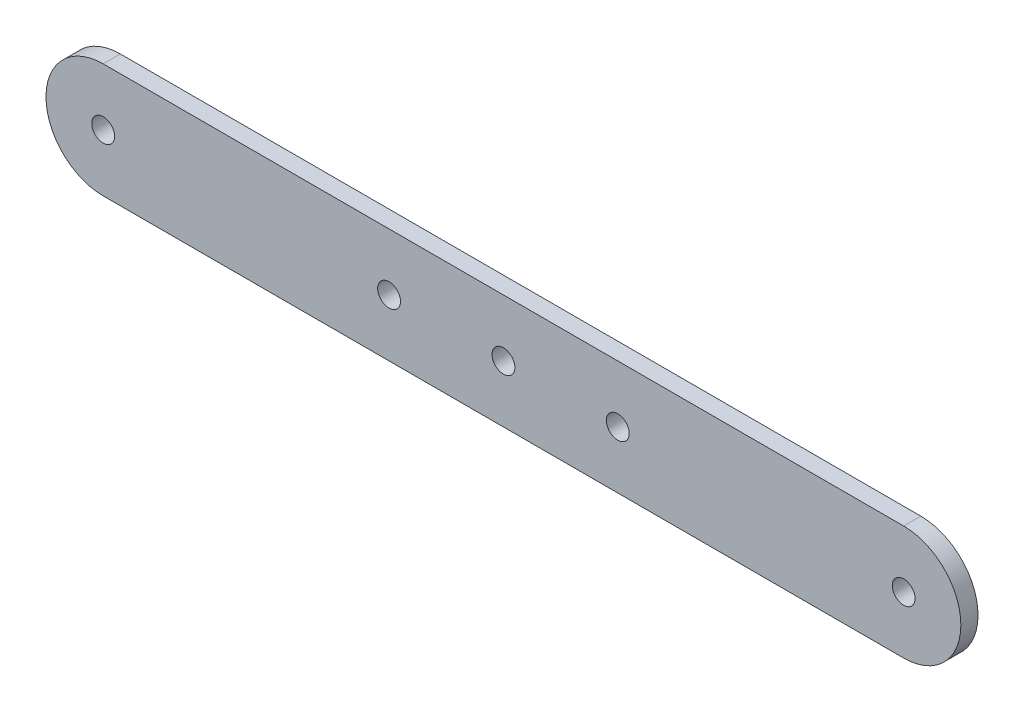
ISO-10303-21;
HEADER;
FILE_DESCRIPTION(('STEP AP214'),'2;1');
FILE_NAME('part.step','',(''),(''),'','','');
FILE_SCHEMA(('AUTOMOTIVE_DESIGN { 1 0 10303 214 1 1 1 1 }'));
ENDSEC;
DATA;
#1=APPLICATION_CONTEXT('core data for automotive mechanical design processes');
#2=APPLICATION_PROTOCOL_DEFINITION('international standard','automotive_design',2000,#1);
#3=PRODUCT_CONTEXT('',#1,'mechanical');
#4=PRODUCT('Part','Part','',(#3));
#5=PRODUCT_RELATED_PRODUCT_CATEGORY('part','',(#4));
#6=PRODUCT_DEFINITION_FORMATION('','',#4);
#7=PRODUCT_DEFINITION_CONTEXT('part definition',#1,'design');
#8=PRODUCT_DEFINITION('design','',#6,#7);
#9=PRODUCT_DEFINITION_SHAPE('','',#8);
#10=(LENGTH_UNIT() NAMED_UNIT(*) SI_UNIT(.MILLI.,.METRE.));
#11=(NAMED_UNIT(*) PLANE_ANGLE_UNIT() SI_UNIT($,.RADIAN.));
#12=(NAMED_UNIT(*) SI_UNIT($,.STERADIAN.) SOLID_ANGLE_UNIT());
#13=UNCERTAINTY_MEASURE_WITH_UNIT(LENGTH_MEASURE(1.E-05),#10,'distance_accuracy_value','');
#14=(GEOMETRIC_REPRESENTATION_CONTEXT(3) GLOBAL_UNCERTAINTY_ASSIGNED_CONTEXT((#13)) GLOBAL_UNIT_ASSIGNED_CONTEXT((#10,
#11,#12)) REPRESENTATION_CONTEXT('',''));
#15=CARTESIAN_POINT('',(0.,0.,0.));
#16=DIRECTION('',(0.,0.,1.));
#17=DIRECTION('',(1.,0.,0.));
#18=AXIS2_PLACEMENT_3D('',#15,#16,#17);
#19=CARTESIAN_POINT('',(-35.,0.,1.5));
#20=DIRECTION('',(0.,0.,-1.));
#21=DIRECTION('',(-1.,0.,0.));
#22=AXIS2_PLACEMENT_3D('',#19,#20,#21);
#23=PLANE('',#22);
#24=CARTESIAN_POINT('',(-35.,0.,1.5));
#25=DIRECTION('',(0.,0.,-1.));
#26=DIRECTION('',(-1.,0.,0.));
#27=AXIS2_PLACEMENT_3D('',#24,#25,#26);
#28=CIRCLE('',#27,5.);
#29=CARTESIAN_POINT('',(-35.,-4.99999999999999,1.5));
#30=VERTEX_POINT('',#29);
#31=CARTESIAN_POINT('',(-35.,5.00000000000001,1.5));
#32=VERTEX_POINT('',#31);
#33=EDGE_CURVE('E169',#30,#32,#28,.T.);
#34=ORIENTED_EDGE('',*,*,#33,.F.);
#35=DIRECTION('',(1.,0.,0.));
#36=VECTOR('',#35,1.);
#37=CARTESIAN_POINT('',(-35.,-4.99999999999999,1.5));
#38=LINE('',#37,#36);
#39=CARTESIAN_POINT('',(35.,-5.00000000000002,1.5));
#40=VERTEX_POINT('',#39);
#41=EDGE_CURVE('E159',#30,#40,#38,.T.);
#42=ORIENTED_EDGE('',*,*,#41,.T.);
#43=CARTESIAN_POINT('',(35.,0.,1.5));
#44=DIRECTION('',(0.,0.,1.));
#45=DIRECTION('',(1.,0.,0.));
#46=AXIS2_PLACEMENT_3D('',#43,#44,#45);
#47=CIRCLE('',#46,5.00000000000002);
#48=CARTESIAN_POINT('',(35.,5.00000000000002,1.5));
#49=VERTEX_POINT('',#48);
#50=EDGE_CURVE('E154',#40,#49,#47,.T.);
#51=ORIENTED_EDGE('',*,*,#50,.T.);
#52=DIRECTION('',(1.,0.,0.));
#53=VECTOR('',#52,1.);
#54=CARTESIAN_POINT('',(-35.,5.00000000000001,1.5));
#55=LINE('',#54,#53);
#56=EDGE_CURVE('E158',#32,#49,#55,.T.);
#57=ORIENTED_EDGE('',*,*,#56,.F.);
#58=EDGE_LOOP('',(#34,#42,#51,#57));
#59=FACE_BOUND('',#58,.T.);
#60=CARTESIAN_POINT('',(-35.,0.,1.5));
#61=DIRECTION('',(0.,0.,1.));
#62=DIRECTION('',(1.,0.,0.));
#63=AXIS2_PLACEMENT_3D('',#60,#61,#62);
#64=CIRCLE('',#63,0.999999999999998);
#65=CARTESIAN_POINT('',(-34.,0.,1.5));
#66=VERTEX_POINT('',#65);
#67=EDGE_CURVE('E179',#66,#66,#64,.T.);
#68=ORIENTED_EDGE('',*,*,#67,.F.);
#69=EDGE_LOOP('',(#68));
#70=FACE_BOUND('',#69,.T.);
#71=CARTESIAN_POINT('',(-10.,0.,1.5));
#72=DIRECTION('',(0.,0.,1.));
#73=DIRECTION('',(1.,0.,0.));
#74=AXIS2_PLACEMENT_3D('',#71,#72,#73);
#75=CIRCLE('',#74,1.);
#76=CARTESIAN_POINT('',(-9.,0.,1.5));
#77=VERTEX_POINT('',#76);
#78=EDGE_CURVE('E221',#77,#77,#75,.T.);
#79=ORIENTED_EDGE('',*,*,#78,.F.);
#80=EDGE_LOOP('',(#79));
#81=FACE_BOUND('',#80,.T.);
#82=CARTESIAN_POINT('',(0.,0.,1.5));
#83=DIRECTION('',(0.,0.,1.));
#84=DIRECTION('',(1.,0.,0.));
#85=AXIS2_PLACEMENT_3D('',#82,#83,#84);
#86=CIRCLE('',#85,1.);
#87=CARTESIAN_POINT('',(1.,0.,1.5));
#88=VERTEX_POINT('',#87);
#89=EDGE_CURVE('E228',#88,#88,#86,.T.);
#90=ORIENTED_EDGE('',*,*,#89,.F.);
#91=EDGE_LOOP('',(#90));
#92=FACE_BOUND('',#91,.T.);
#93=CARTESIAN_POINT('',(10.,0.,1.5));
#94=DIRECTION('',(0.,0.,1.));
#95=DIRECTION('',(1.,0.,0.));
#96=AXIS2_PLACEMENT_3D('',#93,#94,#95);
#97=CIRCLE('',#96,1.);
#98=CARTESIAN_POINT('',(11.,0.,1.5));
#99=VERTEX_POINT('',#98);
#100=EDGE_CURVE('E233',#99,#99,#97,.T.);
#101=ORIENTED_EDGE('',*,*,#100,.F.);
#102=EDGE_LOOP('',(#101));
#103=FACE_BOUND('',#102,.T.);
#104=CARTESIAN_POINT('',(35.,0.,1.5));
#105=DIRECTION('',(0.,0.,1.));
#106=DIRECTION('',(1.,0.,0.));
#107=AXIS2_PLACEMENT_3D('',#104,#105,#106);
#108=CIRCLE('',#107,0.999999999999998);
#109=CARTESIAN_POINT('',(36.,0.,1.5));
#110=VERTEX_POINT('',#109);
#111=EDGE_CURVE('E239',#110,#110,#108,.T.);
#112=ORIENTED_EDGE('',*,*,#111,.F.);
#113=EDGE_LOOP('',(#112));
#114=FACE_BOUND('',#113,.T.);
#115=ADVANCED_FACE('F108',(#59,#70,#81,#92,#103,#114),#23,.F.);
#116=CARTESIAN_POINT('',(-35.,0.,0.));
#117=DIRECTION('',(0.,0.,-1.));
#118=DIRECTION('',(-1.,0.,0.));
#119=AXIS2_PLACEMENT_3D('',#116,#117,#118);
#120=PLANE('',#119);
#121=CARTESIAN_POINT('',(10.,0.,0.));
#122=DIRECTION('',(0.,0.,1.));
#123=DIRECTION('',(1.,0.,0.));
#124=AXIS2_PLACEMENT_3D('',#121,#122,#123);
#125=CIRCLE('',#124,1.);
#126=CARTESIAN_POINT('',(11.,0.,0.));
#127=VERTEX_POINT('',#126);
#128=EDGE_CURVE('E236',#127,#127,#125,.T.);
#129=ORIENTED_EDGE('',*,*,#128,.T.);
#130=EDGE_LOOP('',(#129));
#131=FACE_BOUND('',#130,.T.);
#132=CARTESIAN_POINT('',(-10.,0.,0.));
#133=DIRECTION('',(0.,0.,1.));
#134=DIRECTION('',(1.,0.,0.));
#135=AXIS2_PLACEMENT_3D('',#132,#133,#134);
#136=CIRCLE('',#135,1.);
#137=CARTESIAN_POINT('',(-9.,0.,0.));
#138=VERTEX_POINT('',#137);
#139=EDGE_CURVE('E224',#138,#138,#136,.T.);
#140=ORIENTED_EDGE('',*,*,#139,.T.);
#141=EDGE_LOOP('',(#140));
#142=FACE_BOUND('',#141,.T.);
#143=CARTESIAN_POINT('',(-35.,0.,0.));
#144=DIRECTION('',(0.,0.,-1.));
#145=DIRECTION('',(-1.,0.,0.));
#146=AXIS2_PLACEMENT_3D('',#143,#144,#145);
#147=CIRCLE('',#146,5.);
#148=CARTESIAN_POINT('',(-35.,-4.99999999999999,0.));
#149=VERTEX_POINT('',#148);
#150=CARTESIAN_POINT('',(-35.,5.00000000000001,0.));
#151=VERTEX_POINT('',#150);
#152=EDGE_CURVE('E175',#149,#151,#147,.T.);
#153=ORIENTED_EDGE('',*,*,#152,.T.);
#154=DIRECTION('',(1.,0.,0.));
#155=VECTOR('',#154,1.);
#156=CARTESIAN_POINT('',(-35.,5.00000000000001,0.));
#157=LINE('',#156,#155);
#158=CARTESIAN_POINT('',(35.,5.00000000000002,0.));
#159=VERTEX_POINT('',#158);
#160=EDGE_CURVE('E178',#151,#159,#157,.T.);
#161=ORIENTED_EDGE('',*,*,#160,.T.);
#162=CARTESIAN_POINT('',(35.,0.,0.));
#163=DIRECTION('',(0.,0.,1.));
#164=DIRECTION('',(1.,0.,0.));
#165=AXIS2_PLACEMENT_3D('',#162,#163,#164);
#166=CIRCLE('',#165,5.00000000000002);
#167=CARTESIAN_POINT('',(35.,-5.00000000000002,0.));
#168=VERTEX_POINT('',#167);
#169=EDGE_CURVE('E166',#168,#159,#166,.T.);
#170=ORIENTED_EDGE('',*,*,#169,.F.);
#171=DIRECTION('',(1.,0.,0.));
#172=VECTOR('',#171,1.);
#173=CARTESIAN_POINT('',(-35.,-4.99999999999999,0.));
#174=LINE('',#173,#172);
#175=EDGE_CURVE('E142',#149,#168,#174,.T.);
#176=ORIENTED_EDGE('',*,*,#175,.F.);
#177=EDGE_LOOP('',(#153,#161,#170,#176));
#178=FACE_BOUND('',#177,.T.);
#179=CARTESIAN_POINT('',(-35.,0.,0.));
#180=DIRECTION('',(0.,0.,1.));
#181=DIRECTION('',(1.,0.,0.));
#182=AXIS2_PLACEMENT_3D('',#179,#180,#181);
#183=CIRCLE('',#182,0.999999999999998);
#184=CARTESIAN_POINT('',(-34.,0.,0.));
#185=VERTEX_POINT('',#184);
#186=EDGE_CURVE('E220',#185,#185,#183,.T.);
#187=ORIENTED_EDGE('',*,*,#186,.T.);
#188=EDGE_LOOP('',(#187));
#189=FACE_BOUND('',#188,.T.);
#190=CARTESIAN_POINT('',(0.,0.,0.));
#191=DIRECTION('',(0.,0.,1.));
#192=DIRECTION('',(1.,0.,0.));
#193=AXIS2_PLACEMENT_3D('',#190,#191,#192);
#194=CIRCLE('',#193,1.);
#195=CARTESIAN_POINT('',(1.,0.,0.));
#196=VERTEX_POINT('',#195);
#197=EDGE_CURVE('E230',#196,#196,#194,.T.);
#198=ORIENTED_EDGE('',*,*,#197,.T.);
#199=EDGE_LOOP('',(#198));
#200=FACE_BOUND('',#199,.T.);
#201=CARTESIAN_POINT('',(35.,0.,0.));
#202=DIRECTION('',(0.,0.,1.));
#203=DIRECTION('',(1.,0.,0.));
#204=AXIS2_PLACEMENT_3D('',#201,#202,#203);
#205=CIRCLE('',#204,0.999999999999998);
#206=CARTESIAN_POINT('',(36.,0.,0.));
#207=VERTEX_POINT('',#206);
#208=EDGE_CURVE('E242',#207,#207,#205,.T.);
#209=ORIENTED_EDGE('',*,*,#208,.T.);
#210=EDGE_LOOP('',(#209));
#211=FACE_BOUND('',#210,.T.);
#212=ADVANCED_FACE('F184',(#131,#142,#178,#189,#200,#211),#120,.T.);
#213=CARTESIAN_POINT('',(-35.,0.,1.5));
#214=DIRECTION('',(0.,0.,-1.));
#215=DIRECTION('',(-1.,0.,0.));
#216=AXIS2_PLACEMENT_3D('',#213,#214,#215);
#217=CYLINDRICAL_SURFACE('',#216,5.);
#218=ORIENTED_EDGE('',*,*,#152,.F.);
#219=DIRECTION('',(0.,0.,-1.));
#220=VECTOR('',#219,1.);
#221=CARTESIAN_POINT('',(-35.,-4.99999999999999,1.5));
#222=LINE('',#221,#220);
#223=EDGE_CURVE('E12',#30,#149,#222,.T.);
#224=ORIENTED_EDGE('',*,*,#223,.F.);
#225=ORIENTED_EDGE('',*,*,#33,.T.);
#226=DIRECTION('',(0.,0.,-1.));
#227=VECTOR('',#226,1.);
#228=CARTESIAN_POINT('',(-35.,5.00000000000001,1.5));
#229=LINE('',#228,#227);
#230=EDGE_CURVE('E112',#32,#151,#229,.T.);
#231=ORIENTED_EDGE('',*,*,#230,.T.);
#232=EDGE_LOOP('',(#218,#224,#225,#231));
#233=FACE_BOUND('',#232,.T.);
#234=ADVANCED_FACE('F110',(#233),#217,.T.);
#235=CARTESIAN_POINT('',(-35.,-4.99999999999999,1.5));
#236=DIRECTION('',(0.,1.,0.));
#237=DIRECTION('',(-1.,0.,0.));
#238=AXIS2_PLACEMENT_3D('',#235,#236,#237);
#239=PLANE('',#238);
#240=ORIENTED_EDGE('',*,*,#175,.T.);
#241=DIRECTION('',(0.,0.,-1.));
#242=VECTOR('',#241,1.);
#243=CARTESIAN_POINT('',(35.,-5.00000000000002,1.5));
#244=LINE('',#243,#242);
#245=EDGE_CURVE('E118',#40,#168,#244,.T.);
#246=ORIENTED_EDGE('',*,*,#245,.F.);
#247=ORIENTED_EDGE('',*,*,#41,.F.);
#248=ORIENTED_EDGE('',*,*,#223,.T.);
#249=EDGE_LOOP('',(#240,#246,#247,#248));
#250=FACE_BOUND('',#249,.T.);
#251=ADVANCED_FACE('F187',(#250),#239,.F.);
#252=CARTESIAN_POINT('',(35.,0.,1.5));
#253=DIRECTION('',(0.,0.,-1.));
#254=DIRECTION('',(-1.,0.,0.));
#255=AXIS2_PLACEMENT_3D('',#252,#253,#254);
#256=CYLINDRICAL_SURFACE('',#255,5.00000000000002);
#257=ORIENTED_EDGE('',*,*,#169,.T.);
#258=DIRECTION('',(0.,0.,-1.));
#259=VECTOR('',#258,1.);
#260=CARTESIAN_POINT('',(35.,5.00000000000002,1.5));
#261=LINE('',#260,#259);
#262=EDGE_CURVE('E163',#49,#159,#261,.T.);
#263=ORIENTED_EDGE('',*,*,#262,.F.);
#264=ORIENTED_EDGE('',*,*,#50,.F.);
#265=ORIENTED_EDGE('',*,*,#245,.T.);
#266=EDGE_LOOP('',(#257,#263,#264,#265));
#267=FACE_BOUND('',#266,.T.);
#268=ADVANCED_FACE('F164',(#267),#256,.T.);
#269=CARTESIAN_POINT('',(-35.,5.00000000000001,1.5));
#270=DIRECTION('',(0.,1.,0.));
#271=DIRECTION('',(-1.,0.,0.));
#272=AXIS2_PLACEMENT_3D('',#269,#270,#271);
#273=PLANE('',#272);
#274=ORIENTED_EDGE('',*,*,#160,.F.);
#275=ORIENTED_EDGE('',*,*,#230,.F.);
#276=ORIENTED_EDGE('',*,*,#56,.T.);
#277=ORIENTED_EDGE('',*,*,#262,.T.);
#278=EDGE_LOOP('',(#274,#275,#276,#277));
#279=FACE_BOUND('',#278,.T.);
#280=ADVANCED_FACE('F168',(#279),#273,.T.);
#281=CARTESIAN_POINT('',(-35.,0.,1.5));
#282=DIRECTION('',(0.,0.,-1.));
#283=DIRECTION('',(-1.,0.,0.));
#284=AXIS2_PLACEMENT_3D('',#281,#282,#283);
#285=CYLINDRICAL_SURFACE('',#284,0.999999999999998);
#286=ORIENTED_EDGE('',*,*,#67,.T.);
#287=EDGE_LOOP('',(#286));
#288=FACE_BOUND('',#287,.T.);
#289=ORIENTED_EDGE('',*,*,#186,.F.);
#290=EDGE_LOOP('',(#289));
#291=FACE_BOUND('',#290,.T.);
#292=ADVANCED_FACE('F200',(#288,#291),#285,.F.);
#293=CARTESIAN_POINT('',(-10.,0.,1.5));
#294=DIRECTION('',(0.,0.,-1.));
#295=DIRECTION('',(-1.,0.,0.));
#296=AXIS2_PLACEMENT_3D('',#293,#294,#295);
#297=CYLINDRICAL_SURFACE('',#296,1.);
#298=ORIENTED_EDGE('',*,*,#78,.T.);
#299=EDGE_LOOP('',(#298));
#300=FACE_BOUND('',#299,.T.);
#301=ORIENTED_EDGE('',*,*,#139,.F.);
#302=EDGE_LOOP('',(#301));
#303=FACE_BOUND('',#302,.T.);
#304=ADVANCED_FACE('F208',(#300,#303),#297,.F.);
#305=CARTESIAN_POINT('',(0.,0.,1.5));
#306=DIRECTION('',(0.,0.,-1.));
#307=DIRECTION('',(-1.,0.,0.));
#308=AXIS2_PLACEMENT_3D('',#305,#306,#307);
#309=CYLINDRICAL_SURFACE('',#308,1.);
#310=ORIENTED_EDGE('',*,*,#89,.T.);
#311=EDGE_LOOP('',(#310));
#312=FACE_BOUND('',#311,.T.);
#313=ORIENTED_EDGE('',*,*,#197,.F.);
#314=EDGE_LOOP('',(#313));
#315=FACE_BOUND('',#314,.T.);
#316=ADVANCED_FACE('F213',(#312,#315),#309,.F.);
#317=CARTESIAN_POINT('',(10.,0.,1.5));
#318=DIRECTION('',(0.,0.,-1.));
#319=DIRECTION('',(-1.,0.,0.));
#320=AXIS2_PLACEMENT_3D('',#317,#318,#319);
#321=CYLINDRICAL_SURFACE('',#320,1.);
#322=ORIENTED_EDGE('',*,*,#100,.T.);
#323=EDGE_LOOP('',(#322));
#324=FACE_BOUND('',#323,.T.);
#325=ORIENTED_EDGE('',*,*,#128,.F.);
#326=EDGE_LOOP('',(#325));
#327=FACE_BOUND('',#326,.T.);
#328=ADVANCED_FACE('F252',(#324,#327),#321,.F.);
#329=CARTESIAN_POINT('',(35.,0.,1.5));
#330=DIRECTION('',(0.,0.,-1.));
#331=DIRECTION('',(-1.,0.,0.));
#332=AXIS2_PLACEMENT_3D('',#329,#330,#331);
#333=CYLINDRICAL_SURFACE('',#332,0.999999999999998);
#334=ORIENTED_EDGE('',*,*,#111,.T.);
#335=EDGE_LOOP('',(#334));
#336=FACE_BOUND('',#335,.T.);
#337=ORIENTED_EDGE('',*,*,#208,.F.);
#338=EDGE_LOOP('',(#337));
#339=FACE_BOUND('',#338,.T.);
#340=ADVANCED_FACE('F248',(#336,#339),#333,.F.);
#341=CLOSED_SHELL('',(#115,#212,#234,#251,#268,#280,#292,#304,#316,#328,#340));
#342=MANIFOLD_SOLID_BREP('B2',#341);
#343=ADVANCED_BREP_SHAPE_REPRESENTATION('',(#18,#342),#14);
#344=SHAPE_DEFINITION_REPRESENTATION(#9,#343);
ENDSEC;
END-ISO-10303-21;
